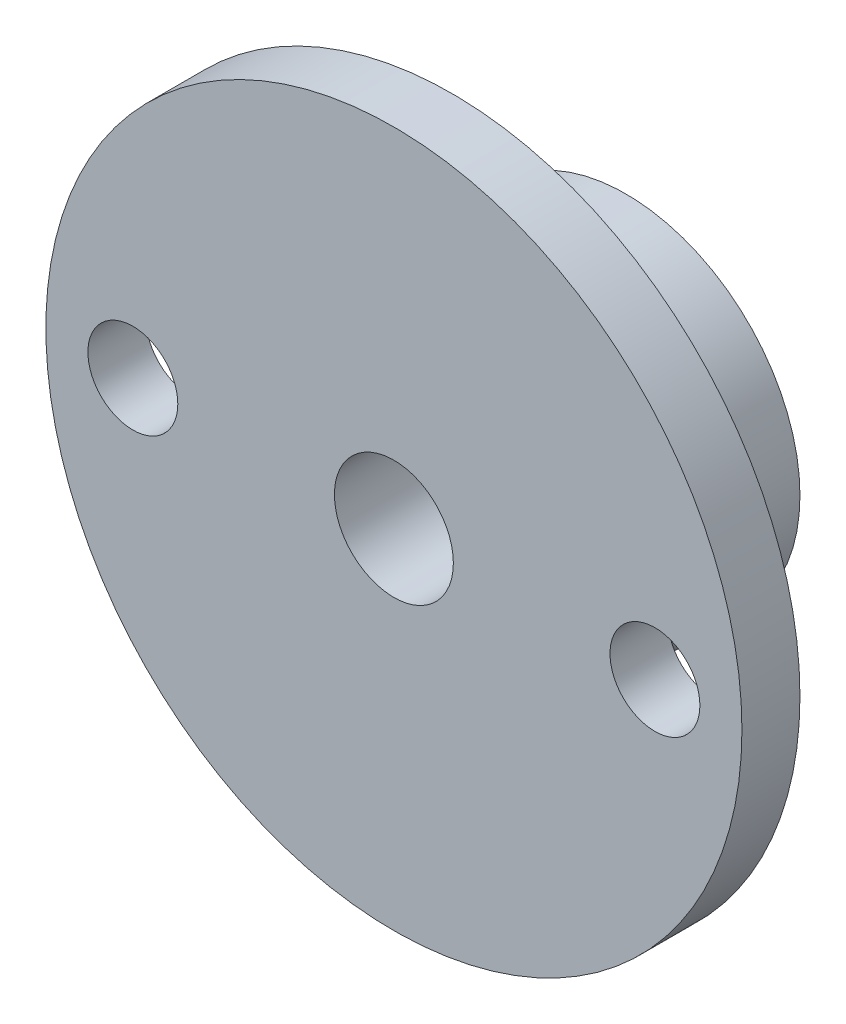
ISO-10303-21;
HEADER;
FILE_DESCRIPTION(('STEP AP214'),'2;1');
FILE_NAME('part.step','',(''),(''),'','','');
FILE_SCHEMA(('AUTOMOTIVE_DESIGN { 1 0 10303 214 1 1 1 1 }'));
ENDSEC;
DATA;
#1=APPLICATION_CONTEXT('core data for automotive mechanical design processes');
#2=APPLICATION_PROTOCOL_DEFINITION('international standard','automotive_design',2000,#1);
#3=PRODUCT_CONTEXT('',#1,'mechanical');
#4=PRODUCT('Part','Part','',(#3));
#5=PRODUCT_RELATED_PRODUCT_CATEGORY('part','',(#4));
#6=PRODUCT_DEFINITION_FORMATION('','',#4);
#7=PRODUCT_DEFINITION_CONTEXT('part definition',#1,'design');
#8=PRODUCT_DEFINITION('design','',#6,#7);
#9=PRODUCT_DEFINITION_SHAPE('','',#8);
#10=(LENGTH_UNIT() NAMED_UNIT(*) SI_UNIT(.MILLI.,.METRE.));
#11=(NAMED_UNIT(*) PLANE_ANGLE_UNIT() SI_UNIT($,.RADIAN.));
#12=(NAMED_UNIT(*) SI_UNIT($,.STERADIAN.) SOLID_ANGLE_UNIT());
#13=UNCERTAINTY_MEASURE_WITH_UNIT(LENGTH_MEASURE(1.E-05),#10,'distance_accuracy_value','');
#14=(GEOMETRIC_REPRESENTATION_CONTEXT(3) GLOBAL_UNCERTAINTY_ASSIGNED_CONTEXT((#13)) GLOBAL_UNIT_ASSIGNED_CONTEXT((#10,
#11,#12)) REPRESENTATION_CONTEXT('',''));
#15=CARTESIAN_POINT('',(0.,0.,0.));
#16=DIRECTION('',(0.,0.,1.));
#17=DIRECTION('',(1.,0.,0.));
#18=AXIS2_PLACEMENT_3D('',#15,#16,#17);
#19=CARTESIAN_POINT('',(0.,0.,6.));
#20=DIRECTION('',(0.,0.,-1.));
#21=DIRECTION('',(-1.,0.,0.));
#22=AXIS2_PLACEMENT_3D('',#19,#20,#21);
#23=CYLINDRICAL_SURFACE('',#22,6.);
#24=CARTESIAN_POINT('',(0.,-6.,4.5));
#25=CARTESIAN_POINT('',(0.0828760886697294,-5.99999859868013,4.49999767426184));
#26=CARTESIAN_POINT('',(0.165778157830762,-5.99826578131828,4.49310844922621));
#27=CARTESIAN_POINT('',(0.329206323770531,-5.99152113829892,4.465774848693));
#28=CARTESIAN_POINT('',(0.409731046870737,-5.98650745419968,4.44532279046215));
#29=CARTESIAN_POINT('',(0.566020872182575,-5.9737562633204,4.39156074653791));
#30=CARTESIAN_POINT('',(0.641791563430001,-5.96602202842087,4.35826620128472));
#31=CARTESIAN_POINT('',(0.786672131904424,-5.94865343807593,4.27981860995517));
#32=CARTESIAN_POINT('',(0.855781784348757,-5.9390190185405,4.23466516388106));
#33=CARTESIAN_POINT('',(0.986801927300918,-5.91867413591801,4.13279921034579));
#34=CARTESIAN_POINT('',(1.04855569006107,-5.90794707148533,4.07588842504082));
#35=CARTESIAN_POINT('',(1.1617489272033,-5.8867362011753,3.95254779509108));
#36=CARTESIAN_POINT('',(1.21318723694913,-5.87625242288349,3.8861168770535));
#37=CARTESIAN_POINT('',(1.30502654279903,-5.8565477569971,3.74440477326256));
#38=CARTESIAN_POINT('',(1.34525221592535,-5.84734794470605,3.6690067691896));
#39=CARTESIAN_POINT('',(1.41239690855053,-5.83149494812223,3.51225158834164));
#40=CARTESIAN_POINT('',(1.43931805543933,-5.82484135672789,3.43089536667424));
#41=CARTESIAN_POINT('',(1.47855483680429,-5.81500476717551,3.26625650179753));
#42=CARTESIAN_POINT('',(1.49115226833334,-5.81175491075426,3.1830451039502));
#43=CARTESIAN_POINT('',(1.50226177506785,-5.80889362537741,3.01563143098602));
#44=CARTESIAN_POINT('',(1.50077614181798,-5.80928160448644,2.93142931930139));
#45=CARTESIAN_POINT('',(1.48398652463928,-5.81359205496618,2.76658419225552));
#46=CARTESIAN_POINT('',(1.46901834019052,-5.81742863001879,2.68590437853491));
#47=CARTESIAN_POINT('',(1.4262241869031,-5.82806709676484,2.52823894908871));
#48=CARTESIAN_POINT('',(1.39839730206942,-5.83486919970697,2.45125359697102));
#49=CARTESIAN_POINT('',(1.33038947793715,-5.85075113904187,2.30226198374794));
#50=CARTESIAN_POINT('',(1.29008666723291,-5.85985327469421,2.23031382821045));
#51=CARTESIAN_POINT('',(1.19835627601495,-5.87929710846386,2.09408129024316));
#52=CARTESIAN_POINT('',(1.14692674880884,-5.88963902334735,2.02979825193275));
#53=CARTESIAN_POINT('',(1.03266342468122,-5.91075880539781,1.9087963843056));
#54=CARTESIAN_POINT('',(0.969546258165859,-5.92154069477971,1.85234550993865));
#55=CARTESIAN_POINT('',(0.834611917503699,-5.94205965578786,1.7507787575361));
#56=CARTESIAN_POINT('',(0.762794477707943,-5.95179669549415,1.70566322573644));
#57=CARTESIAN_POINT('',(0.612115888681391,-5.96917732094183,1.62794941377562));
#58=CARTESIAN_POINT('',(0.533231393208623,-5.97681360127725,1.59539465974557));
#59=CARTESIAN_POINT('',(0.370876008142882,-5.98907916991419,1.54408269429043));
#60=CARTESIAN_POINT('',(0.287405999150484,-5.99370903339281,1.52532284358186));
#61=CARTESIAN_POINT('',(0.120539970390026,-5.99935499271375,1.50254243444116));
#62=CARTESIAN_POINT('',(0.0371967199882084,-6.00046053508279,1.4981569739247));
#63=CARTESIAN_POINT('',(-0.129032874801509,-5.99918804814451,1.50324900205549));
#64=CARTESIAN_POINT('',(-0.211919259644596,-5.99681033241847,1.51272524279913));
#65=CARTESIAN_POINT('',(-0.373614268776493,-5.98889581127357,1.54497090839138));
#66=CARTESIAN_POINT('',(-0.452465118968756,-5.98340634185811,1.56754126347699));
#67=CARTESIAN_POINT('',(-0.605257292452512,-5.96988706634134,1.62510708402845));
#68=CARTESIAN_POINT('',(-0.679198119032636,-5.96185700369892,1.66010380431317));
#69=CARTESIAN_POINT('',(-0.821523134429848,-5.9439330792631,1.74223612887473));
#70=CARTESIAN_POINT('',(-0.889785441835831,-5.93400867366932,1.78957611239676));
#71=CARTESIAN_POINT('',(-1.01752661364325,-5.91344509187419,1.89478990879697));
#72=CARTESIAN_POINT('',(-1.07700395897301,-5.90280579251705,1.95266553961691));
#73=CARTESIAN_POINT('',(-1.18699056807273,-5.88168956960771,2.07900196084446));
#74=CARTESIAN_POINT('',(-1.23724386762203,-5.87122304187281,2.14768770300242));
#75=CARTESIAN_POINT('',(-1.3255107590127,-5.85192878377239,2.29273263446572));
#76=CARTESIAN_POINT('',(-1.36352489415794,-5.84310098067026,2.36909148295975));
#77=CARTESIAN_POINT('',(-1.42595142060929,-5.82818094734665,2.52690572241308));
#78=CARTESIAN_POINT('',(-1.45044439665407,-5.82207255291906,2.60832762834401));
#79=CARTESIAN_POINT('',(-1.48534565995378,-5.81326744090184,2.77430963788911));
#80=CARTESIAN_POINT('',(-1.49575702747866,-5.81056997719936,2.85886905103249));
#81=CARTESIAN_POINT('',(-1.502038590334,-5.80894901203957,3.0261210238552));
#82=CARTESIAN_POINT('',(-1.49831789778012,-5.80991932728264,3.10879743512473));
#83=CARTESIAN_POINT('',(-1.47737727831287,-5.81527909007843,3.27230388866798));
#84=CARTESIAN_POINT('',(-1.46015762268677,-5.81966846891857,3.35313396801365));
#85=CARTESIAN_POINT('',(-1.4129313194428,-5.83131260682723,3.51020845906541));
#86=CARTESIAN_POINT('',(-1.38300140468038,-5.83855015236309,3.58647730524021));
#87=CARTESIAN_POINT('',(-1.31126491360507,-5.85507755724829,3.73296538271369));
#88=CARTESIAN_POINT('',(-1.26945669003419,-5.86436770120773,3.80318377318692));
#89=CARTESIAN_POINT('',(-1.17386774863714,-5.88425634263512,3.93755462900202));
#90=CARTESIAN_POINT('',(-1.11980316291226,-5.89488264831757,4.00150107342396));
#91=CARTESIAN_POINT('',(-1.00178937118974,-5.91608027246286,4.11954704479541));
#92=CARTESIAN_POINT('',(-0.937837821261147,-5.9266515772706,4.17364423011297));
#93=CARTESIAN_POINT('',(-0.800467586702591,-5.94677655647663,4.27141130856461));
#94=CARTESIAN_POINT('',(-0.726898422316388,-5.95630833365868,4.31487461367158));
#95=CARTESIAN_POINT('',(-0.573266059510478,-5.97304924975118,4.38874746294053));
#96=CARTESIAN_POINT('',(-0.493207563436741,-5.98026005199781,4.41916636064854));
#97=CARTESIAN_POINT('',(-0.344410253243474,-5.99048059565542,4.46157183032965));
#98=CARTESIAN_POINT('',(-0.27638017090807,-5.99402585052691,4.47595124305343));
#99=CARTESIAN_POINT('',(-0.138906071536285,-5.99878605231948,4.49516594362194));
#100=CARTESIAN_POINT('',(-0.0694621612426181,-6.00000117450894,4.5000019493053));
#101=CARTESIAN_POINT('',(0.,-6.,4.5));
#102=B_SPLINE_CURVE_WITH_KNOTS('',3,(#24,#25,#26,#27,#28,#29,#30,#31,#32,#33,#34,#35,#36,#37,
#38,#39,#40,#41,#42,#43,#44,#45,#46,#47,#48,#49,#50,#51,#52,#53,#54,#55,#56,#57,#58,#59,#60,#61,
#62,#63,#64,#65,#66,#67,#68,#69,#70,#71,#72,#73,#74,#75,#76,#77,#78,#79,#80,#81,#82,#83,#84,#85,
#86,#87,#88,#89,#90,#91,#92,#93,#94,#95,#96,#97,#98,#99,#100,#101),.UNSPECIFIED.,.T.,.F.,(4,2,2,
2,2,2,2,2,2,2,2,2,2,2,2,2,2,2,2,2,2,2,2,2,2,2,2,2,2,2,2,2,2,2,2,2,2,2,4),(0.,0.24837371247189,
0.496888237763899,0.745104902286106,0.993329940169327,1.24614435437139,1.49898729580062,
1.75558647545807,2.01214461169368,2.2635629509943,2.51494038112697,2.76022497007018,
3.00552703466038,3.25330527873879,3.50112690836163,3.75601500969019,4.01091089558247,
4.26668229009114,4.52240473688643,4.77158308949276,5.02073901112743,5.26620274514037,
5.5116912732229,5.76153587565352,6.01142363008019,6.26744509204476,6.52345518749508,
6.77792254614036,7.03233423252408,7.27943780398612,7.52653640956034,7.77216400559447,
8.01782568136901,8.2698957640991,8.52202569770417,8.77872185499588,9.0352336382135,
9.24342242942149,9.45159556043039),.UNSPECIFIED.);
#103=CARTESIAN_POINT('',(0.,-6.,4.5));
#104=VERTEX_POINT('',#103);
#105=EDGE_CURVE('E74',#104,#104,#102,.T.);
#106=ORIENTED_EDGE('',*,*,#105,.T.);
#107=EDGE_LOOP('',(#106));
#108=FACE_BOUND('',#107,.T.);
#109=CARTESIAN_POINT('',(0.,0.,6.));
#110=DIRECTION('',(0.,0.,1.));
#111=DIRECTION('',(1.,0.,0.));
#112=AXIS2_PLACEMENT_3D('',#109,#110,#111);
#113=CIRCLE('',#112,6.);
#114=CARTESIAN_POINT('',(6.,0.,6.));
#115=VERTEX_POINT('',#114);
#116=EDGE_CURVE('E10',#115,#115,#113,.T.);
#117=ORIENTED_EDGE('',*,*,#116,.F.);
#118=EDGE_LOOP('',(#117));
#119=FACE_BOUND('',#118,.T.);
#120=CARTESIAN_POINT('',(0.,0.,0.));
#121=DIRECTION('',(0.,0.,1.));
#122=DIRECTION('',(1.,0.,0.));
#123=AXIS2_PLACEMENT_3D('',#120,#121,#122);
#124=CIRCLE('',#123,6.);
#125=CARTESIAN_POINT('',(6.,0.,0.));
#126=VERTEX_POINT('',#125);
#127=EDGE_CURVE('E44',#126,#126,#124,.T.);
#128=ORIENTED_EDGE('',*,*,#127,.T.);
#129=EDGE_LOOP('',(#128));
#130=FACE_BOUND('',#129,.T.);
#131=ADVANCED_FACE('F31',(#108,#119,#130),#23,.T.);
#132=CARTESIAN_POINT('',(0.,0.,0.));
#133=DIRECTION('',(0.,0.,1.));
#134=DIRECTION('',(1.,0.,0.));
#135=AXIS2_PLACEMENT_3D('',#132,#133,#134);
#136=PLANE('',#135);
#137=CARTESIAN_POINT('',(0.,0.,0.));
#138=DIRECTION('',(0.,0.,1.));
#139=DIRECTION('',(1.,0.,0.));
#140=AXIS2_PLACEMENT_3D('',#137,#138,#139);
#141=CIRCLE('',#140,2.05);
#142=CARTESIAN_POINT('',(2.05,0.,0.));
#143=VERTEX_POINT('',#142);
#144=EDGE_CURVE('E56',#143,#143,#141,.T.);
#145=ORIENTED_EDGE('',*,*,#144,.T.);
#146=EDGE_LOOP('',(#145));
#147=FACE_BOUND('',#146,.T.);
#148=ORIENTED_EDGE('',*,*,#127,.F.);
#149=EDGE_LOOP('',(#148));
#150=FACE_BOUND('',#149,.T.);
#151=ADVANCED_FACE('F102',(#147,#150),#136,.F.);
#152=CARTESIAN_POINT('',(0.,0.,6.));
#153=DIRECTION('',(0.,0.,1.));
#154=DIRECTION('',(1.,0.,0.));
#155=AXIS2_PLACEMENT_3D('',#152,#153,#154);
#156=PLANE('',#155);
#157=CARTESIAN_POINT('',(9.,0.,6.));
#158=DIRECTION('',(0.,0.,1.));
#159=DIRECTION('',(1.,0.,0.));
#160=AXIS2_PLACEMENT_3D('',#157,#158,#159);
#161=CIRCLE('',#160,1.55);
#162=CARTESIAN_POINT('',(10.55,0.,6.));
#163=VERTEX_POINT('',#162);
#164=EDGE_CURVE('E68',#163,#163,#161,.T.);
#165=ORIENTED_EDGE('',*,*,#164,.T.);
#166=EDGE_LOOP('',(#165));
#167=FACE_BOUND('',#166,.T.);
#168=CARTESIAN_POINT('',(-9.,0.,6.));
#169=DIRECTION('',(0.,0.,1.));
#170=DIRECTION('',(1.,0.,0.));
#171=AXIS2_PLACEMENT_3D('',#168,#169,#170);
#172=CIRCLE('',#171,1.55);
#173=CARTESIAN_POINT('',(-7.45,0.,6.));
#174=VERTEX_POINT('',#173);
#175=EDGE_CURVE('E62',#174,#174,#172,.T.);
#176=ORIENTED_EDGE('',*,*,#175,.T.);
#177=EDGE_LOOP('',(#176));
#178=FACE_BOUND('',#177,.T.);
#179=CARTESIAN_POINT('',(0.,0.,6.));
#180=DIRECTION('',(0.,0.,1.));
#181=DIRECTION('',(1.,0.,0.));
#182=AXIS2_PLACEMENT_3D('',#179,#180,#181);
#183=CIRCLE('',#182,12.);
#184=CARTESIAN_POINT('',(12.,0.,6.));
#185=VERTEX_POINT('',#184);
#186=EDGE_CURVE('E53',#185,#185,#183,.T.);
#187=ORIENTED_EDGE('',*,*,#186,.F.);
#188=EDGE_LOOP('',(#187));
#189=FACE_BOUND('',#188,.T.);
#190=ORIENTED_EDGE('',*,*,#116,.T.);
#191=EDGE_LOOP('',(#190));
#192=FACE_BOUND('',#191,.T.);
#193=ADVANCED_FACE('F98',(#167,#178,#189,#192),#156,.F.);
#194=CARTESIAN_POINT('',(0.,0.,8.));
#195=DIRECTION('',(0.,0.,-1.));
#196=DIRECTION('',(-1.,0.,0.));
#197=AXIS2_PLACEMENT_3D('',#194,#195,#196);
#198=CYLINDRICAL_SURFACE('',#197,12.);
#199=CARTESIAN_POINT('',(0.,0.,8.));
#200=DIRECTION('',(0.,0.,1.));
#201=DIRECTION('',(1.,0.,0.));
#202=AXIS2_PLACEMENT_3D('',#199,#200,#201);
#203=CIRCLE('',#202,12.);
#204=CARTESIAN_POINT('',(12.,0.,8.));
#205=VERTEX_POINT('',#204);
#206=EDGE_CURVE('E48',#205,#205,#203,.T.);
#207=ORIENTED_EDGE('',*,*,#206,.F.);
#208=EDGE_LOOP('',(#207));
#209=FACE_BOUND('',#208,.T.);
#210=ORIENTED_EDGE('',*,*,#186,.T.);
#211=EDGE_LOOP('',(#210));
#212=FACE_BOUND('',#211,.T.);
#213=ADVANCED_FACE('F101',(#209,#212),#198,.T.);
#214=CARTESIAN_POINT('',(0.,0.,8.));
#215=DIRECTION('',(0.,0.,1.));
#216=DIRECTION('',(1.,0.,0.));
#217=AXIS2_PLACEMENT_3D('',#214,#215,#216);
#218=PLANE('',#217);
#219=CARTESIAN_POINT('',(9.,0.,8.));
#220=DIRECTION('',(0.,0.,1.));
#221=DIRECTION('',(1.,0.,0.));
#222=AXIS2_PLACEMENT_3D('',#219,#220,#221);
#223=CIRCLE('',#222,1.55);
#224=CARTESIAN_POINT('',(10.55,0.,8.));
#225=VERTEX_POINT('',#224);
#226=EDGE_CURVE('E71',#225,#225,#223,.T.);
#227=ORIENTED_EDGE('',*,*,#226,.F.);
#228=EDGE_LOOP('',(#227));
#229=FACE_BOUND('',#228,.T.);
#230=CARTESIAN_POINT('',(-9.,0.,8.));
#231=DIRECTION('',(0.,0.,1.));
#232=DIRECTION('',(1.,0.,0.));
#233=AXIS2_PLACEMENT_3D('',#230,#231,#232);
#234=CIRCLE('',#233,1.55);
#235=CARTESIAN_POINT('',(-7.45,0.,8.));
#236=VERTEX_POINT('',#235);
#237=EDGE_CURVE('E65',#236,#236,#234,.T.);
#238=ORIENTED_EDGE('',*,*,#237,.F.);
#239=EDGE_LOOP('',(#238));
#240=FACE_BOUND('',#239,.T.);
#241=CARTESIAN_POINT('',(0.,0.,8.));
#242=DIRECTION('',(0.,0.,1.));
#243=DIRECTION('',(1.,0.,0.));
#244=AXIS2_PLACEMENT_3D('',#241,#242,#243);
#245=CIRCLE('',#244,2.05);
#246=CARTESIAN_POINT('',(2.05,0.,8.));
#247=VERTEX_POINT('',#246);
#248=EDGE_CURVE('E59',#247,#247,#245,.T.);
#249=ORIENTED_EDGE('',*,*,#248,.F.);
#250=EDGE_LOOP('',(#249));
#251=FACE_BOUND('',#250,.T.);
#252=ORIENTED_EDGE('',*,*,#206,.T.);
#253=EDGE_LOOP('',(#252));
#254=FACE_BOUND('',#253,.T.);
#255=ADVANCED_FACE('F96',(#229,#240,#251,#254),#218,.T.);
#256=CARTESIAN_POINT('',(0.,0.,0.));
#257=DIRECTION('',(0.,0.,1.));
#258=DIRECTION('',(1.,0.,0.));
#259=AXIS2_PLACEMENT_3D('',#256,#257,#258);
#260=CYLINDRICAL_SURFACE('',#259,2.05);
#261=CARTESIAN_POINT('',(0.,-2.05,4.5));
#262=CARTESIAN_POINT('',(-0.0736645541699394,-2.04999557455054,4.49999536487032));
#263=CARTESIAN_POINT('',(-0.147451361580436,-2.04598708706443,4.49452985480854));
#264=CARTESIAN_POINT('',(-0.292720171427363,-2.03031628176041,4.47300264589157));
#265=CARTESIAN_POINT('',(-0.364195790279564,-2.01863439721989,4.45691385773748));
#266=CARTESIAN_POINT('',(-0.502351269043643,-1.98874583853753,4.41521015882617));
#267=CARTESIAN_POINT('',(-0.569056984261831,-1.97057814890178,4.38965213123984));
#268=CARTESIAN_POINT('',(-0.696820466780423,-1.92910828401678,4.33019240013698));
#269=CARTESIAN_POINT('',(-0.757879974929626,-1.90580769889566,4.29629328024158));
#270=CARTESIAN_POINT('',(-0.878974600164132,-1.85327996587474,4.21781635944393));
#271=CARTESIAN_POINT('',(-0.938407453909169,-1.82370598176577,4.17254625481528));
#272=CARTESIAN_POINT('',(-1.04935746875454,-1.76220961079271,4.07440515478498));
#273=CARTESIAN_POINT('',(-1.10086192304519,-1.73028357291086,4.02152221546021));
#274=CARTESIAN_POINT('',(-1.20473615097505,-1.6600461859559,3.89796326977443));
#275=CARTESIAN_POINT('',(-1.25534711008369,-1.62169397672011,3.82582405496822));
#276=CARTESIAN_POINT('',(-1.34385567293754,-1.54913319052267,3.67222299041084));
#277=CARTESIAN_POINT('',(-1.38177233083955,-1.5149184529776,3.59077536135073));
#278=CARTESIAN_POINT('',(-1.43291459132733,-1.46631010290269,3.44771456900897));
#279=CARTESIAN_POINT('',(-1.45015813606169,-1.4491081113302,3.38850503166973));
#280=CARTESIAN_POINT('',(-1.47735605187029,-1.42137280086755,3.26698008652806));
#281=CARTESIAN_POINT('',(-1.4873267292953,-1.41082457094183,3.2046719634117));
#282=CARTESIAN_POINT('',(-1.49933424266878,-1.39806424591683,3.07791666053465));
#283=CARTESIAN_POINT('',(-1.50131036964724,-1.39591594223184,3.01345684708371));
#284=CARTESIAN_POINT('',(-1.49697487005051,-1.40056141611663,2.88512505475285));
#285=CARTESIAN_POINT('',(-1.49065746079277,-1.40736143292628,2.82125351733047));
#286=CARTESIAN_POINT('',(-1.46914421467263,-1.42981581835315,2.68923178006345));
#287=CARTESIAN_POINT('',(-1.45304431394653,-1.44636569534487,2.6213888526529));
#288=CARTESIAN_POINT('',(-1.41241800405743,-1.48606089204735,2.4902836175254));
#289=CARTESIAN_POINT('',(-1.38787183385896,-1.50922165684335,2.42703247688767));
#290=CARTESIAN_POINT('',(-1.32149425773126,-1.56803362426462,2.2846054484429));
#291=CARTESIAN_POINT('',(-1.27662069854312,-1.605233434408,2.20749468218742));
#292=CARTESIAN_POINT('',(-1.17456012669744,-1.68136246377685,2.0628485386396));
#293=CARTESIAN_POINT('',(-1.1173592530454,-1.72029359028535,1.99532408326575));
#294=CARTESIAN_POINT('',(-0.990371112630746,-1.79644834867789,1.86985179892646));
#295=CARTESIAN_POINT('',(-0.920423005713055,-1.8336414964417,1.81204695505277));
#296=CARTESIAN_POINT('',(-0.769268005228422,-1.90199023539516,1.70905319594615));
#297=CARTESIAN_POINT('',(-0.688087552764538,-1.9331596052877,1.66383538234152));
#298=CARTESIAN_POINT('',(-0.538207436597274,-1.97922123004423,1.59814062240448));
#299=CARTESIAN_POINT('',(-0.471634462119275,-1.99623772718083,1.57429332526309));
#300=CARTESIAN_POINT('',(-0.334527315040306,-2.02372535847694,1.53605216140614));
#301=CARTESIAN_POINT('',(-0.263996112133563,-2.03420133002224,1.52165130768186));
#302=CARTESIAN_POINT('',(-0.120600145325723,-2.04772049374847,1.50310319342416));
#303=CARTESIAN_POINT('',(-0.0477275087898649,-2.05073519152121,1.49899524047133));
#304=CARTESIAN_POINT('',(0.0977467281938146,-2.04895968464559,1.50142177556858));
#305=CARTESIAN_POINT('',(0.170348323545055,-2.04416933396684,1.50795646273963));
#306=CARTESIAN_POINT('',(0.308724365763488,-2.02774746830803,1.53053937748139));
#307=CARTESIAN_POINT('',(0.374648148974849,-2.01653935117606,1.54599926266328));
#308=CARTESIAN_POINT('',(0.502713167981759,-1.98848713080471,1.58516175245188));
#309=CARTESIAN_POINT('',(0.564853610518929,-1.97164185039048,1.60886607873626));
#310=CARTESIAN_POINT('',(0.689132816852739,-1.9318878201279,1.66578136118287));
#311=CARTESIAN_POINT('',(0.750866850830904,-1.90859948458405,1.69960507457239));
#312=CARTESIAN_POINT('',(0.867968847215969,-1.85827866471816,1.7746532538988));
#313=CARTESIAN_POINT('',(0.923332753094362,-1.83124381848865,1.81588239332167));
#314=CARTESIAN_POINT('',(1.03682397286532,-1.76985341439226,1.91300685825464));
#315=CARTESIAN_POINT('',(1.09360081170611,-1.73506384496132,1.97020532182987));
#316=CARTESIAN_POINT('',(1.19731087491147,-1.66518962228043,2.09285800989506));
#317=CARTESIAN_POINT('',(1.24423528561181,-1.6301047337781,2.15831954316177));
#318=CARTESIAN_POINT('',(1.32312902288905,-1.56656120372554,2.2896770634843));
#319=CARTESIAN_POINT('',(1.35615882476119,-1.53779480627221,2.35478433714041));
#320=CARTESIAN_POINT('',(1.41291272063144,-1.48581938303921,2.49098740743026));
#321=CARTESIAN_POINT('',(1.43665621646698,-1.46259881036972,2.56207033727716));
#322=CARTESIAN_POINT('',(1.46935149073412,-1.42965818089487,2.69266776876887));
#323=CARTESIAN_POINT('',(1.48043349891081,-1.41807300341029,2.75116597985044));
#324=CARTESIAN_POINT('',(1.49555161797816,-1.40212425294942,2.8700034275123));
#325=CARTESIAN_POINT('',(1.49959826077462,-1.39774988593687,2.93033977438546));
#326=CARTESIAN_POINT('',(1.5003451977955,-1.3969485321308,3.05124125605515));
#327=CARTESIAN_POINT('',(1.4970300729804,-1.40053822585011,3.11180660530967));
#328=CARTESIAN_POINT('',(1.48329148070309,-1.41507599115702,3.23124363534277));
#329=CARTESIAN_POINT('',(1.47285823479779,-1.42603418484414,3.29011287000658));
#330=CARTESIAN_POINT('',(1.44154573019902,-1.45776156448448,3.42160815870621));
#331=CARTESIAN_POINT('',(1.41850812555956,-1.48045941002889,3.49324268872674));
#332=CARTESIAN_POINT('',(1.36303990157746,-1.53168111814912,3.63058590116442));
#333=CARTESIAN_POINT('',(1.33058477026104,-1.56022012626716,3.6962785250729));
#334=CARTESIAN_POINT('',(1.24746944408314,-1.62785001356673,3.83799881911068));
#335=CARTESIAN_POINT('',(1.19426424774972,-1.6677337957351,3.91215634501249));
#336=CARTESIAN_POINT('',(1.07522193889443,-1.7468573131283,4.04984071490974));
#337=CARTESIAN_POINT('',(1.00939267395048,-1.78609743211258,4.11337411755238));
#338=CARTESIAN_POINT('',(0.877107798536321,-1.85413298021575,4.21929193666004));
#339=CARTESIAN_POINT('',(0.812406788660297,-1.88359794901534,4.26343243761176));
#340=CARTESIAN_POINT('',(0.67515746067032,-1.93702407432252,4.34178399156384));
#341=CARTESIAN_POINT('',(0.602617105963947,-1.96099074025875,4.37600499327855));
#342=CARTESIAN_POINT('',(0.462317192011554,-1.99830790110585,4.42864391198433));
#343=CARTESIAN_POINT('',(0.395431009217097,-2.01270292850566,4.44864837926339));
#344=CARTESIAN_POINT('',(0.258550164418264,-2.0348035590171,4.47920215510696));
#345=CARTESIAN_POINT('',(0.188564056942653,-2.04252649622795,4.48977596685669));
#346=CARTESIAN_POINT('',(0.0984524426773305,-2.04772982798432,4.49689598733902));
#347=CARTESIAN_POINT('',(0.0787929080878778,-2.048579801482,4.49805858516581));
#348=CARTESIAN_POINT('',(0.0394251721090265,-2.04971551310578,4.49961125748875));
#349=CARTESIAN_POINT('',(0.019716965240558,-2.05000118451044,4.50000124063319));
#350=CARTESIAN_POINT('',(0.,-2.05,4.5));
#351=B_SPLINE_CURVE_WITH_KNOTS('',3,(#261,#262,#263,#264,#265,#266,#267,#268,#269,#270,#271,
#272,#273,#274,#275,#276,#277,#278,#279,#280,#281,#282,#283,#284,#285,#286,#287,#288,#289,#290,
#291,#292,#293,#294,#295,#296,#297,#298,#299,#300,#301,#302,#303,#304,#305,#306,#307,#308,#309,
#310,#311,#312,#313,#314,#315,#316,#317,#318,#319,#320,#321,#322,#323,#324,#325,#326,#327,#328,
#329,#330,#331,#332,#333,#334,#335,#336,#337,#338,#339,#340,#341,#342,#343,#344,#345,#346,#347,
#348,#349,#350),.UNSPECIFIED.,.T.,.F.,(4,2,2,2,2,2,2,2,2,2,2,2,2,2,2,2,2,2,2,2,2,2,2,2,2,2,2,2,
2,2,2,2,2,2,2,2,2,2,2,2,2,2,2,2,4),(0.,0.220907485233337,0.442380470099748,0.662544051909396,
0.882639524557007,1.12282543414092,1.36339236819981,1.65048137899578,1.93713751648741,
2.12853026601187,2.31949256748167,2.51190230585803,2.70444627353801,2.91826981751639,
3.1325970669765,3.42110394211627,3.70993692667695,4.00270445801705,4.29479417832145,
4.51209357641629,4.72923206846164,4.9471985358974,5.16516908147474,5.37018833492614,
5.57525042805759,5.79685909676791,6.01860811491735,6.28096376393172,6.54355311721224,
6.77817738021138,7.01230879117284,7.19352509569975,7.37446988601036,7.55579401806688,
7.73736774510938,7.97186478758938,8.20697774023453,8.50435399328344,8.8015459822408,
9.05161167557909,9.30142569199744,9.51438706522724,9.72679348624617,9.7859143260036,
9.84504215561996),.UNSPECIFIED.);
#352=CARTESIAN_POINT('',(0.,-2.05,4.5));
#353=VERTEX_POINT('',#352);
#354=EDGE_CURVE('E35',#353,#353,#351,.T.);
#355=ORIENTED_EDGE('',*,*,#354,.T.);
#356=EDGE_LOOP('',(#355));
#357=FACE_BOUND('',#356,.T.);
#358=ORIENTED_EDGE('',*,*,#144,.F.);
#359=EDGE_LOOP('',(#358));
#360=FACE_BOUND('',#359,.T.);
#361=ORIENTED_EDGE('',*,*,#248,.T.);
#362=EDGE_LOOP('',(#361));
#363=FACE_BOUND('',#362,.T.);
#364=ADVANCED_FACE('F91',(#357,#360,#363),#260,.F.);
#365=CARTESIAN_POINT('',(-9.,0.,0.));
#366=DIRECTION('',(0.,0.,1.));
#367=DIRECTION('',(1.,0.,0.));
#368=AXIS2_PLACEMENT_3D('',#365,#366,#367);
#369=CYLINDRICAL_SURFACE('',#368,1.55);
#370=ORIENTED_EDGE('',*,*,#237,.T.);
#371=EDGE_LOOP('',(#370));
#372=FACE_BOUND('',#371,.T.);
#373=ORIENTED_EDGE('',*,*,#175,.F.);
#374=EDGE_LOOP('',(#373));
#375=FACE_BOUND('',#374,.T.);
#376=ADVANCED_FACE('F88',(#372,#375),#369,.F.);
#377=CARTESIAN_POINT('',(9.,0.,0.));
#378=DIRECTION('',(0.,0.,1.));
#379=DIRECTION('',(1.,0.,0.));
#380=AXIS2_PLACEMENT_3D('',#377,#378,#379);
#381=CYLINDRICAL_SURFACE('',#380,1.55);
#382=ORIENTED_EDGE('',*,*,#226,.T.);
#383=EDGE_LOOP('',(#382));
#384=FACE_BOUND('',#383,.T.);
#385=ORIENTED_EDGE('',*,*,#164,.F.);
#386=EDGE_LOOP('',(#385));
#387=FACE_BOUND('',#386,.T.);
#388=ADVANCED_FACE('F83',(#384,#387),#381,.F.);
#389=CARTESIAN_POINT('',(0.,-10.,3.));
#390=DIRECTION('',(0.,1.,0.));
#391=DIRECTION('',(0.,0.,1.));
#392=AXIS2_PLACEMENT_3D('',#389,#390,#391);
#393=CYLINDRICAL_SURFACE('',#392,1.5);
#394=ORIENTED_EDGE('',*,*,#354,.F.);
#395=EDGE_LOOP('',(#394));
#396=FACE_BOUND('',#395,.T.);
#397=ORIENTED_EDGE('',*,*,#105,.F.);
#398=EDGE_LOOP('',(#397));
#399=FACE_BOUND('',#398,.T.);
#400=ADVANCED_FACE('F79',(#396,#399),#393,.F.);
#401=CLOSED_SHELL('',(#131,#151,#193,#213,#255,#364,#376,#388,#400));
#402=MANIFOLD_SOLID_BREP('B2',#401);
#403=ADVANCED_BREP_SHAPE_REPRESENTATION('',(#18,#402),#14);
#404=SHAPE_DEFINITION_REPRESENTATION(#9,#403);
ENDSEC;
END-ISO-10303-21;
